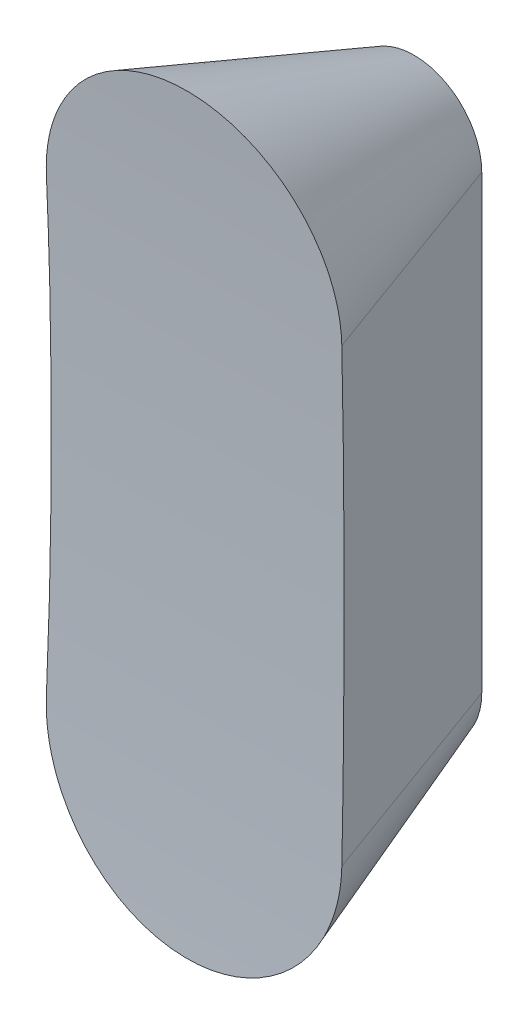
ISO-10303-21;
HEADER;
FILE_DESCRIPTION(('STEP AP214'),'2;1');
FILE_NAME('part.step','',(''),(''),'','','');
FILE_SCHEMA(('AUTOMOTIVE_DESIGN { 1 0 10303 214 1 1 1 1 }'));
ENDSEC;
DATA;
#1=APPLICATION_CONTEXT('core data for automotive mechanical design processes');
#2=APPLICATION_PROTOCOL_DEFINITION('international standard','automotive_design',2000,#1);
#3=PRODUCT_CONTEXT('',#1,'mechanical');
#4=PRODUCT('Part','Part','',(#3));
#5=PRODUCT_RELATED_PRODUCT_CATEGORY('part','',(#4));
#6=PRODUCT_DEFINITION_FORMATION('','',#4);
#7=PRODUCT_DEFINITION_CONTEXT('part definition',#1,'design');
#8=PRODUCT_DEFINITION('design','',#6,#7);
#9=PRODUCT_DEFINITION_SHAPE('','',#8);
#10=(LENGTH_UNIT() NAMED_UNIT(*) SI_UNIT(.MILLI.,.METRE.));
#11=(NAMED_UNIT(*) PLANE_ANGLE_UNIT() SI_UNIT($,.RADIAN.));
#12=(NAMED_UNIT(*) SI_UNIT($,.STERADIAN.) SOLID_ANGLE_UNIT());
#13=UNCERTAINTY_MEASURE_WITH_UNIT(LENGTH_MEASURE(1.E-05),#10,'distance_accuracy_value','');
#14=(GEOMETRIC_REPRESENTATION_CONTEXT(3) GLOBAL_UNCERTAINTY_ASSIGNED_CONTEXT((#13)) GLOBAL_UNIT_ASSIGNED_CONTEXT((#10,
#11,#12)) REPRESENTATION_CONTEXT('',''));
#15=CARTESIAN_POINT('',(0.,0.,0.));
#16=DIRECTION('',(0.,0.,1.));
#17=DIRECTION('',(1.,0.,0.));
#18=AXIS2_PLACEMENT_3D('',#15,#16,#17);
#19=CARTESIAN_POINT('',(0.,250.,0.));
#20=DIRECTION('',(0.,0.,1.));
#21=DIRECTION('',(1.,0.,0.));
#22=AXIS2_PLACEMENT_3D('',#19,#20,#21);
#23=CONICAL_SURFACE('',#22,75.,0.349065850398867);
#24=DIRECTION('',(-0.342020143325669,0.,0.939692620785908));
#25=VECTOR('',#24,1.);
#26=CARTESIAN_POINT('',(-75.,250.,0.));
#27=LINE('',#26,#25);
#28=CARTESIAN_POINT('',(-163.808429496129,250.,243.999154697842));
#29=VERTEX_POINT('',#28);
#30=CARTESIAN_POINT('',(-75.,250.,0.));
#31=VERTEX_POINT('',#30);
#32=EDGE_CURVE('E52',#29,#31,#27,.F.);
#33=ORIENTED_EDGE('',*,*,#32,.F.);
#34=CARTESIAN_POINT('',(-163.808429496129,250.,243.999154697842));
#35=CARTESIAN_POINT('',(-163.824138974877,251.302593004817,244.042316746006));
#36=CARTESIAN_POINT('',(-163.824453488186,252.605308736778,244.085870428773));
#37=CARTESIAN_POINT('',(-163.794301054113,255.210357488361,244.173744609212));
#38=CARTESIAN_POINT('',(-163.763834120106,256.512690508149,244.218065106549));
#39=CARTESIAN_POINT('',(-163.626278469396,260.418043877899,244.35214769571));
#40=CARTESIAN_POINT('',(-163.473036483805,263.019549812274,244.443035233635));
#41=CARTESIAN_POINT('',(-163.043839186392,268.212260958937,244.627613557107));
#42=CARTESIAN_POINT('',(-162.767881563357,270.80346597629,244.72130439542));
#43=CARTESIAN_POINT('',(-162.093876599138,275.969928107472,244.911284981619));
#44=CARTESIAN_POINT('',(-161.695827103908,278.54518493911,245.007574775331));
#45=CARTESIAN_POINT('',(-160.779361008814,283.669309997764,245.20234034975));
#46=CARTESIAN_POINT('',(-160.26116230374,286.21821737261,245.300811884859));
#47=CARTESIAN_POINT('',(-159.105185662647,291.288567928056,245.499844608021));
#48=CARTESIAN_POINT('',(-158.467413054901,293.810012327125,245.600405702785));
#49=CARTESIAN_POINT('',(-157.073723565553,298.81978279249,245.803330914476));
#50=CARTESIAN_POINT('',(-156.317814978152,301.308111170529,245.905694904376));
#51=CARTESIAN_POINT('',(-154.6895829523,306.246010779123,246.11191147049));
#52=CARTESIAN_POINT('',(-153.817270697398,308.695585707682,246.215763902845));
#53=CARTESIAN_POINT('',(-151.778637815122,314.019354071065,246.444793120821));
#54=CARTESIAN_POINT('',(-150.588063754621,316.884286118912,246.570218240378));
#55=CARTESIAN_POINT('',(-148.047641029103,322.542298009979,246.822110753892));
#56=CARTESIAN_POINT('',(-146.697802986562,325.335382630111,246.948578077816));
#57=CARTESIAN_POINT('',(-143.842988731992,330.841038742583,247.201910206078));
#58=CARTESIAN_POINT('',(-142.338015647273,333.553611856506,247.328775002354));
#59=CARTESIAN_POINT('',(-139.178188361029,338.8886252872,247.582161292581));
#60=CARTESIAN_POINT('',(-137.523391764012,341.511099714845,247.708682899373));
#61=CARTESIAN_POINT('',(-134.068557164362,346.658653278721,247.960702210907));
#62=CARTESIAN_POINT('',(-132.268516793272,349.183730825729,248.086199898917));
#63=CARTESIAN_POINT('',(-128.528729307526,354.128438362874,248.335411993899));
#64=CARTESIAN_POINT('',(-126.588982117752,356.548068296312,248.459126399914));
#65=CARTESIAN_POINT('',(-123.080172029691,360.680179860328,248.673212369987));
#66=CARTESIAN_POINT('',(-121.540401664562,362.417608623296,248.764152736807));
#67=CARTESIAN_POINT('',(-118.388533524097,365.825950287013,248.944259217922));
#68=CARTESIAN_POINT('',(-116.776431171362,367.496858965496,249.033425219412));
#69=CARTESIAN_POINT('',(-113.483007412971,370.768798836694,249.209624130734));
#70=CARTESIAN_POINT('',(-111.801692320131,372.369836374956,249.296657233955));
#71=CARTESIAN_POINT('',(-108.372453604261,375.499463731837,249.46826482141));
#72=CARTESIAN_POINT('',(-106.624522362655,377.028045218873,249.552839022468));
#73=CARTESIAN_POINT('',(-103.064980023868,380.010035950845,249.719189086808));
#74=CARTESIAN_POINT('',(-101.253356976029,381.463430960547,249.800964419188));
#75=CARTESIAN_POINT('',(-97.5701634565894,384.291893045529,249.961347575202));
#76=CARTESIAN_POINT('',(-95.6985999332024,385.66696914845,250.0399557636));
#77=CARTESIAN_POINT('',(-91.898464584018,388.336551001351,250.193683144911));
#78=CARTESIAN_POINT('',(-89.9698877997245,389.631049712854,250.268802032886));
#79=CARTESIAN_POINT('',(-86.0595033157494,392.136823313228,250.415204974088));
#80=CARTESIAN_POINT('',(-84.0776991130961,393.348103651012,250.486489278325));
#81=CARTESIAN_POINT('',(-79.4104473017019,396.065994744086,250.647453872934));
#82=CARTESIAN_POINT('',(-76.7060486216337,397.540305754713,250.735564109122));
#83=CARTESIAN_POINT('',(-71.2182044082453,400.33392712875,250.903765467903));
#84=CARTESIAN_POINT('',(-68.4347589529521,401.653237645153,250.983856598412));
#85=CARTESIAN_POINT('',(-62.7975377416053,404.132531526956,251.135351919846));
#86=CARTESIAN_POINT('',(-59.9437621467421,405.292515257477,251.206756130679));
#87=CARTESIAN_POINT('',(-54.1753009252702,407.449137756237,251.340255924183));
#88=CARTESIAN_POINT('',(-51.2606222084204,408.445794942437,251.402352556381));
#89=CARTESIAN_POINT('',(-45.3793330399593,410.272576785312,251.516702575467));
#90=CARTESIAN_POINT('',(-42.4127224375371,411.102700958286,251.568955933764));
#91=CARTESIAN_POINT('',(-36.4371083490548,412.593599210427,251.663152008003));
#92=CARTESIAN_POINT('',(-33.4281052263547,413.254374740204,251.705094812262));
#93=CARTESIAN_POINT('',(-27.3992388337108,414.400183565596,251.778025526137));
#94=CARTESIAN_POINT('',(-24.3796113361672,414.88645282753,251.809090440358));
#95=CARTESIAN_POINT('',(-18.3176833901209,415.688247523905,251.860403388091));
#96=CARTESIAN_POINT('',(-15.2753829908981,416.003773329349,251.880651445107));
#97=CARTESIAN_POINT('',(-9.1778017649429,416.463019085553,251.910146176003));
#98=CARTESIAN_POINT('',(-6.12252099192,416.606739746506,251.919392895359));
#99=CARTESIAN_POINT('',(-0.00870408280918963,416.721893381376,251.926800476216));
#100=CARTESIAN_POINT('',(3.04983204942047,416.693326559261,251.92496135084));
#101=CARTESIAN_POINT('',(9.16042689096425,416.464001588579,251.910214100336));
#102=CARTESIAN_POINT('',(12.2124855740793,416.263242744878,251.897305930522));
#103=CARTESIAN_POINT('',(18.300374840055,415.690210444177,251.860538626549));
#104=CARTESIAN_POINT('',(21.3362055191224,415.317938005127,251.836679557386));
#105=CARTESIAN_POINT('',(27.3702280017173,414.404912500142,251.778341219325));
#106=CARTESIAN_POINT('',(30.3685203102199,413.864820802491,251.743903645819));
#107=CARTESIAN_POINT('',(36.3299937905105,412.617496457932,251.664685720728));
#108=CARTESIAN_POINT('',(39.2931749826225,411.910263907779,251.619905375129));
#109=CARTESIAN_POINT('',(45.1751050768416,410.33100685625,251.520397377204));
#110=CARTESIAN_POINT('',(48.0938541938086,409.458983152027,251.465669772995));
#111=CARTESIAN_POINT('',(53.8778134979388,407.553015851563,251.346742323385));
#112=CARTESIAN_POINT('',(56.7430234172335,406.519071445438,251.282542430605));
#113=CARTESIAN_POINT('',(62.4109665239395,404.29265793842,251.14521774178));
#114=CARTESIAN_POINT('',(65.2136994665428,403.100188216493,251.072092910771));
#115=CARTESIAN_POINT('',(70.7479719819577,400.560624223612,250.917528696037));
#116=CARTESIAN_POINT('',(73.479511594811,399.213530039625,250.836089316989));
#117=CARTESIAN_POINT('',(78.8704102335064,396.365152124639,250.665322680705));
#118=CARTESIAN_POINT('',(81.5295485299199,394.863451909788,250.575974213373));
#119=CARTESIAN_POINT('',(86.7595299980269,391.713835021106,250.390294226348));
#120=CARTESIAN_POINT('',(89.3303728434509,390.065917807055,250.293962680854));
#121=CARTESIAN_POINT('',(94.3758259306913,386.629192867642,250.095061532535));
#122=CARTESIAN_POINT('',(96.8504364882494,384.840385604604,249.992491950178));
#123=CARTESIAN_POINT('',(101.695767412705,381.127665712563,249.781884786001));
#124=CARTESIAN_POINT('',(104.066491318424,379.203757691486,249.673847390707));
#125=CARTESIAN_POINT('',(108.696884358183,375.226928486421,249.453082335658));
#126=CARTESIAN_POINT('',(110.95655325801,373.174007030364,249.340354666012));
#127=CARTESIAN_POINT('',(115.358031095059,368.945566559879,249.110988774493));
#128=CARTESIAN_POINT('',(117.499839947216,366.770047456965,248.994350549799));
#129=CARTESIAN_POINT('',(121.149649450327,362.850408704804,248.78690036393));
#130=CARTESIAN_POINT('',(122.684430261428,361.131091280692,248.696757713221));
#131=CARTESIAN_POINT('',(125.680548290378,357.629432003796,248.515012114357));
#132=CARTESIAN_POINT('',(127.141880812691,355.847086133992,248.423409073332));
#133=CARTESIAN_POINT('',(129.988325128863,352.2228316597,248.239083282353));
#134=CARTESIAN_POINT('',(131.373442748867,350.380927625193,248.146360618649));
#135=CARTESIAN_POINT('',(134.06536124714,346.6404742092,247.960095611615));
#136=CARTESIAN_POINT('',(135.372153285619,344.741918470109,247.866553177125));
#137=CARTESIAN_POINT('',(137.905517154398,340.890942376669,247.678930560874));
#138=CARTESIAN_POINT('',(139.132056292289,338.938500525721,247.584850176732));
#139=CARTESIAN_POINT('',(141.502096226837,334.984163245174,247.396499793453));
#140=CARTESIAN_POINT('',(142.645606308883,332.982273379157,247.302229816734));
#141=CARTESIAN_POINT('',(144.847845907257,328.932224220805,247.113772331347));
#142=CARTESIAN_POINT('',(145.906570577155,326.884062292075,247.019584827696));
#143=CARTESIAN_POINT('',(147.937263707518,322.745371863848,246.831582601732));
#144=CARTESIAN_POINT('',(148.909237503368,320.654845979552,246.737767856833));
#145=CARTESIAN_POINT('',(151.08265404974,315.712160424311,246.518739353487));
#146=CARTESIAN_POINT('',(152.248695528943,312.844335735073,246.393774665203));
#147=CARTESIAN_POINT('',(154.417943827059,307.047629896744,246.145577024355));
#148=CARTESIAN_POINT('',(155.421143316862,304.118746006224,246.022344149964));
#149=CARTESIAN_POINT('',(157.261711374175,298.208762152271,245.778145491592));
#150=CARTESIAN_POINT('',(158.099056704662,295.227654935677,245.657180027433));
#151=CARTESIAN_POINT('',(159.603972289303,289.227584861189,245.418219157647));
#152=CARTESIAN_POINT('',(160.271798356496,286.208686344324,245.30021952184));
#153=CARTESIAN_POINT('',(161.437155618205,280.13859642502,245.067470112903));
#154=CARTESIAN_POINT('',(161.934712032255,277.087409874007,244.952719860801));
#155=CARTESIAN_POINT('',(162.757881082237,270.963290915224,244.726903371373));
#156=CARTESIAN_POINT('',(163.083588690863,267.890371471846,244.615835131051));
#157=CARTESIAN_POINT('',(163.41881311453,263.578429410696,244.463106687411));
#158=CARTESIAN_POINT('',(163.500812668356,262.344748136089,244.419766533345));
#159=CARTESIAN_POINT('',(163.637116079956,259.876034440405,244.333748945228));
#160=CARTESIAN_POINT('',(163.691425228728,258.641002322673,244.291071386083));
#161=CARTESIAN_POINT('',(163.772273077254,256.17188682894,244.206455128159));
#162=CARTESIAN_POINT('',(163.798853687804,254.937804846552,244.164515408774));
#163=CARTESIAN_POINT('',(163.82437960108,252.46909847415,244.081317537346));
#164=CARTESIAN_POINT('',(163.823319676493,251.234474025694,244.040059515701));
#165=CARTESIAN_POINT('',(163.808429496129,250.,243.999154697842));
#166=B_SPLINE_CURVE_WITH_KNOTS('',3,(#34,#35,#36,#37,#38,#39,#40,#41,#42,#43,#44,#45,#46,#47,
#48,#49,#50,#51,#52,#53,#54,#55,#56,#57,#58,#59,#60,#61,#62,#63,#64,#65,#66,#67,#68,#69,#70,#71,
#72,#73,#74,#75,#76,#77,#78,#79,#80,#81,#82,#83,#84,#85,#86,#87,#88,#89,#90,#91,#92,#93,#94,#95,
#96,#97,#98,#99,#100,#101,#102,#103,#104,#105,#106,#107,#108,#109,#110,#111,#112,#113,#114,#115,
#116,#117,#118,#119,#120,#121,#122,#123,#124,#125,#126,#127,#128,#129,#130,#131,#132,#133,#134,
#135,#136,#137,#138,#139,#140,#141,#142,#143,#144,#145,#146,#147,#148,#149,#150,#151,#152,#153,
#154,#155,#156,#157,#158,#159,#160,#161,#162,#163,#164,#165),.UNSPECIFIED.,.F.,.F.,(4,2,2,2,2,2,
2,2,2,2,2,2,2,2,2,2,2,2,2,2,2,2,2,2,2,2,2,2,2,2,2,2,2,2,2,2,2,2,2,2,2,2,2,2,2,2,2,2,2,2,2,2,2,2,
2,2,2,2,2,2,2,2,2,2,2,4),(0.,3.91001699583537,7.82003229279667,15.6396692184233,
23.4594534244418,31.2793756015378,39.0852254934816,46.890727635524,54.6956820075476,
62.4998870532013,71.8098322484426,81.1191568461507,90.4282938173458,99.7338666663532,
109.039591289972,118.345320917184,125.313334356295,132.281789377104,139.249610215161,
146.218230335492,153.188165048213,160.157294719653,167.127032296313,174.09631307767,
183.335427199796,192.57453220231,201.813616031608,211.051657272546,220.289725345344,
229.52771428378,238.698918642362,247.87010307303,257.041249592571,266.212385254548,
275.383557940264,284.554676194755,293.690100316407,302.825519149742,311.960893792906,
321.096314130155,330.23177025707,339.367221245753,348.527959684747,357.688731970894,
366.849474197671,376.009904127587,385.170353375962,394.330809235932,401.248259582074,
408.16615159839,415.083514049055,422.001655725962,428.92259830358,435.842765695369,
442.763328369782,449.683465119424,458.973364649304,468.263682178472,477.555300409771,
486.832812631783,496.108950117267,505.379955737063,509.091218170006,512.801771200256,
516.50670768673,520.212344847321),.UNSPECIFIED.);
#167=CARTESIAN_POINT('',(163.808429496129,250.,243.999154697842));
#168=VERTEX_POINT('',#167);
#169=EDGE_CURVE('E84',#29,#168,#166,.T.);
#170=ORIENTED_EDGE('',*,*,#169,.T.);
#171=DIRECTION('',(0.342020143325669,0.,0.939692620785908));
#172=VECTOR('',#171,1.);
#173=CARTESIAN_POINT('',(75.,250.,0.));
#174=LINE('',#173,#172);
#175=CARTESIAN_POINT('',(75.,250.,0.));
#176=VERTEX_POINT('',#175);
#177=EDGE_CURVE('E66',#168,#176,#174,.F.);
#178=ORIENTED_EDGE('',*,*,#177,.T.);
#179=CARTESIAN_POINT('',(0.,250.,0.));
#180=DIRECTION('',(0.,0.,1.));
#181=DIRECTION('',(1.,0.,0.));
#182=AXIS2_PLACEMENT_3D('',#179,#180,#181);
#183=CIRCLE('',#182,75.);
#184=EDGE_CURVE('E89',#176,#31,#183,.T.);
#185=ORIENTED_EDGE('',*,*,#184,.T.);
#186=EDGE_LOOP('',(#33,#170,#178,#185));
#187=FACE_BOUND('',#186,.T.);
#188=ADVANCED_FACE('F37',(#187),#23,.T.);
#189=CARTESIAN_POINT('',(-75.,-250.,0.));
#190=DIRECTION('',(-0.939692620785908,0.,-0.342020143325669));
#191=DIRECTION('',(-0.342020143325669,0.,0.939692620785908));
#192=AXIS2_PLACEMENT_3D('',#189,#190,#191);
#193=PLANE('',#192);
#194=DIRECTION('',(-0.342020143325669,0.,0.939692620785908));
#195=VECTOR('',#194,1.);
#196=CARTESIAN_POINT('',(-75.,-250.,0.));
#197=LINE('',#196,#195);
#198=CARTESIAN_POINT('',(-163.808429496129,-250.,243.999154697842));
#199=VERTEX_POINT('',#198);
#200=CARTESIAN_POINT('',(-75.,-250.,0.));
#201=VERTEX_POINT('',#200);
#202=EDGE_CURVE('E98',#199,#201,#197,.F.);
#203=ORIENTED_EDGE('',*,*,#202,.F.);
#204=CARTESIAN_POINT('',(-163.808429496129,-250.,243.999154697842));
#205=CARTESIAN_POINT('',(-163.724693625356,-243.05639621235,243.769092283694));
#206=CARTESIAN_POINT('',(-163.644944676802,-236.112384270873,243.549983848317));
#207=CARTESIAN_POINT('',(-163.493177895972,-222.223643063474,243.133008044963));
#208=CARTESIAN_POINT('',(-163.421160057853,-215.278913798099,242.935140660933));
#209=CARTESIAN_POINT('',(-163.284624305591,-201.39001269945,242.560011764646));
#210=CARTESIAN_POINT('',(-163.220105112502,-194.445840973578,242.382746738511));
#211=CARTESIAN_POINT('',(-163.09835360853,-180.556952580874,242.048237230564));
#212=CARTESIAN_POINT('',(-163.041121299247,-173.612235913923,241.890992753147));
#213=CARTESIAN_POINT('',(-162.880100147947,-152.779196918257,241.448590775895));
#214=CARTESIAN_POINT('',(-162.786969222547,-138.890158906917,241.192715661306));
#215=CARTESIAN_POINT('',(-162.6280475878,-111.112081519346,240.756082058375));
#216=CARTESIAN_POINT('',(-162.562254280758,-97.2230422687103,240.575316432925));
#217=CARTESIAN_POINT('',(-162.457271612517,-69.4449823613137,240.286878922499));
#218=CARTESIAN_POINT('',(-162.418080570569,-55.5559617588304,240.179202419702));
#219=CARTESIAN_POINT('',(-162.365873308315,-27.7779607616904,240.035764145527));
#220=CARTESIAN_POINT('',(-162.352856223889,-13.8889803808452,240.));
#221=CARTESIAN_POINT('',(-162.352856223889,13.8889803808452,240.));
#222=CARTESIAN_POINT('',(-162.365873308315,27.7779607616904,240.035764145527));
#223=CARTESIAN_POINT('',(-162.418080570569,55.5559617588303,240.179202419702));
#224=CARTESIAN_POINT('',(-162.457271612517,69.4449823613137,240.286878922498));
#225=CARTESIAN_POINT('',(-162.562254280758,97.2230422687103,240.575316432925));
#226=CARTESIAN_POINT('',(-162.6280475878,111.112081519346,240.756082058374));
#227=CARTESIAN_POINT('',(-162.786969222547,138.890158906917,241.192715661306));
#228=CARTESIAN_POINT('',(-162.880100147947,152.779196918257,241.448590775895));
#229=CARTESIAN_POINT('',(-163.041121299247,173.612235913923,241.890992753147));
#230=CARTESIAN_POINT('',(-163.09835360853,180.556952580874,242.048237230564));
#231=CARTESIAN_POINT('',(-163.220105112502,194.445840973578,242.382746738511));
#232=CARTESIAN_POINT('',(-163.284624305591,201.39001269945,242.560011764646));
#233=CARTESIAN_POINT('',(-163.421160057853,215.278913798099,242.935140660933));
#234=CARTESIAN_POINT('',(-163.493177895972,222.223643063474,243.133008044963));
#235=CARTESIAN_POINT('',(-163.644944676802,236.112384270873,243.549983848316));
#236=CARTESIAN_POINT('',(-163.724693625356,243.05639621235,243.769092283694));
#237=CARTESIAN_POINT('',(-163.808429496129,250.,243.999154697842));
#238=B_SPLINE_CURVE_WITH_KNOTS('',3,(#204,#205,#206,#207,#208,#209,#210,#211,#212,#213,#214,
#215,#216,#217,#218,#219,#220,#221,#222,#223,#224,#225,#226,#227,#228,#229,#230,#231,#232,#233,
#234,#235,#236,#237),.UNSPECIFIED.,.F.,.F.,(4,2,2,2,2,2,2,2,2,2,2,2,2,2,2,2,4),(0.,
20.8437418955119,41.6874680362387,62.5276338979756,83.3678043338471,125.042662993465,
166.713560689117,208.381825344629,250.048714321282,291.715603297935,333.383867953447,
375.054765649099,416.729624308717,437.569794744588,458.409960606325,479.253686747052,
500.097428642564),.UNSPECIFIED.);
#239=EDGE_CURVE('E90',#199,#29,#238,.T.);
#240=ORIENTED_EDGE('',*,*,#239,.T.);
#241=ORIENTED_EDGE('',*,*,#32,.T.);
#242=DIRECTION('',(0.,-1.,0.));
#243=VECTOR('',#242,1.);
#244=CARTESIAN_POINT('',(-75.,-250.,0.));
#245=LINE('',#244,#243);
#246=EDGE_CURVE('E109',#31,#201,#245,.T.);
#247=ORIENTED_EDGE('',*,*,#246,.T.);
#248=EDGE_LOOP('',(#203,#240,#241,#247));
#249=FACE_BOUND('',#248,.T.);
#250=ADVANCED_FACE('F39',(#249),#193,.T.);
#251=CARTESIAN_POINT('',(0.,-250.,0.));
#252=DIRECTION('',(0.,0.,1.));
#253=DIRECTION('',(-1.,0.,0.));
#254=AXIS2_PLACEMENT_3D('',#251,#252,#253);
#255=CONICAL_SURFACE('',#254,75.,0.349065850398867);
#256=DIRECTION('',(0.342020143325669,0.,0.939692620785908));
#257=VECTOR('',#256,1.);
#258=CARTESIAN_POINT('',(75.,-250.,0.));
#259=LINE('',#258,#257);
#260=CARTESIAN_POINT('',(163.808429496129,-250.,243.999154697842));
#261=VERTEX_POINT('',#260);
#262=CARTESIAN_POINT('',(75.,-250.,0.));
#263=VERTEX_POINT('',#262);
#264=EDGE_CURVE('E96',#261,#263,#259,.F.);
#265=ORIENTED_EDGE('',*,*,#264,.F.);
#266=CARTESIAN_POINT('',(163.808429496129,-250.,243.999154697842));
#267=CARTESIAN_POINT('',(163.824138974877,-251.302593004817,244.042316746006));
#268=CARTESIAN_POINT('',(163.824453488186,-252.605308736778,244.085870428774));
#269=CARTESIAN_POINT('',(163.794301054114,-255.210357488361,244.173744609212));
#270=CARTESIAN_POINT('',(163.763834120106,-256.512690508149,244.21806510655));
#271=CARTESIAN_POINT('',(163.626278469396,-260.418043877899,244.35214769571));
#272=CARTESIAN_POINT('',(163.473036483805,-263.019549812274,244.443035233635));
#273=CARTESIAN_POINT('',(163.043839186392,-268.212260958937,244.627613557107));
#274=CARTESIAN_POINT('',(162.767881563357,-270.80346597629,244.72130439542));
#275=CARTESIAN_POINT('',(162.093876599138,-275.969928107472,244.911284981619));
#276=CARTESIAN_POINT('',(161.695827103908,-278.54518493911,245.007574775331));
#277=CARTESIAN_POINT('',(160.779361008814,-283.669309997764,245.20234034975));
#278=CARTESIAN_POINT('',(160.26116230374,-286.21821737261,245.300811884859));
#279=CARTESIAN_POINT('',(159.105185662647,-291.288567928056,245.499844608021));
#280=CARTESIAN_POINT('',(158.467413054901,-293.810012327125,245.600405702785));
#281=CARTESIAN_POINT('',(157.073723565553,-298.81978279249,245.803330914476));
#282=CARTESIAN_POINT('',(156.317814978152,-301.308111170529,245.905694904376));
#283=CARTESIAN_POINT('',(154.6895829523,-306.246010779123,246.11191147049));
#284=CARTESIAN_POINT('',(153.817270697398,-308.695585707682,246.215763902845));
#285=CARTESIAN_POINT('',(151.778637815122,-314.019354071065,246.444793120821));
#286=CARTESIAN_POINT('',(150.588063754621,-316.884286118912,246.570218240378));
#287=CARTESIAN_POINT('',(148.047641029103,-322.542298009979,246.822110753893));
#288=CARTESIAN_POINT('',(146.697802986562,-325.335382630111,246.948578077816));
#289=CARTESIAN_POINT('',(143.842988731992,-330.841038742584,247.201910206078));
#290=CARTESIAN_POINT('',(142.338015647273,-333.553611856507,247.328775002354));
#291=CARTESIAN_POINT('',(139.178188361029,-338.8886252872,247.582161292581));
#292=CARTESIAN_POINT('',(137.523391764012,-341.511099714845,247.708682899373));
#293=CARTESIAN_POINT('',(134.068557164362,-346.658653278721,247.960702210908));
#294=CARTESIAN_POINT('',(132.268516793272,-349.183730825729,248.086199898917));
#295=CARTESIAN_POINT('',(128.528729307526,-354.128438362874,248.3354119939));
#296=CARTESIAN_POINT('',(126.588982117752,-356.548068296312,248.459126399915));
#297=CARTESIAN_POINT('',(123.080172029691,-360.680179860328,248.673212369987));
#298=CARTESIAN_POINT('',(121.540401664562,-362.417608623296,248.764152736807));
#299=CARTESIAN_POINT('',(118.388533524097,-365.825950287013,248.944259217922));
#300=CARTESIAN_POINT('',(116.776431171362,-367.496858965496,249.033425219413));
#301=CARTESIAN_POINT('',(113.483007412972,-370.768798836694,249.209624130735));
#302=CARTESIAN_POINT('',(111.801692320131,-372.369836374957,249.296657233956));
#303=CARTESIAN_POINT('',(108.372453604261,-375.499463731837,249.46826482141));
#304=CARTESIAN_POINT('',(106.624522362655,-377.028045218873,249.552839022469));
#305=CARTESIAN_POINT('',(103.064980023868,-380.010035950845,249.719189086808));
#306=CARTESIAN_POINT('',(101.253356976029,-381.463430960547,249.800964419188));
#307=CARTESIAN_POINT('',(97.5701634565895,-384.291893045529,249.961347575203));
#308=CARTESIAN_POINT('',(95.6985999332026,-385.66696914845,250.039955763601));
#309=CARTESIAN_POINT('',(91.8984645840182,-388.336551001351,250.193683144911));
#310=CARTESIAN_POINT('',(89.9698877997247,-389.631049712854,250.268802032886));
#311=CARTESIAN_POINT('',(86.0595033157495,-392.136823313228,250.415204974088));
#312=CARTESIAN_POINT('',(84.0776991130962,-393.348103651012,250.486489278326));
#313=CARTESIAN_POINT('',(79.410447301702,-396.065994744086,250.647453872934));
#314=CARTESIAN_POINT('',(76.7060486216339,-397.540305754713,250.735564109122));
#315=CARTESIAN_POINT('',(71.2182044082455,-400.33392712875,250.903765467903));
#316=CARTESIAN_POINT('',(68.4347589529522,-401.653237645154,250.983856598412));
#317=CARTESIAN_POINT('',(62.7975377416055,-404.132531526956,251.135351919847));
#318=CARTESIAN_POINT('',(59.9437621467422,-405.292515257477,251.20675613068));
#319=CARTESIAN_POINT('',(54.1753009252703,-407.449137756237,251.340255924184));
#320=CARTESIAN_POINT('',(51.2606222084205,-408.445794942437,251.402352556381));
#321=CARTESIAN_POINT('',(45.3793330399595,-410.272576785312,251.516702575467));
#322=CARTESIAN_POINT('',(42.4127224375373,-411.102700958287,251.568955933765));
#323=CARTESIAN_POINT('',(36.4371083490549,-412.593599210427,251.663152008003));
#324=CARTESIAN_POINT('',(33.4281052263548,-413.254374740204,251.705094812263));
#325=CARTESIAN_POINT('',(27.3992388337108,-414.400183565596,251.778025526137));
#326=CARTESIAN_POINT('',(24.3796113361673,-414.88645282753,251.809090440358));
#327=CARTESIAN_POINT('',(18.317683390121,-415.688247523905,251.860403388091));
#328=CARTESIAN_POINT('',(15.2753829908982,-416.003773329349,251.880651445107));
#329=CARTESIAN_POINT('',(9.17780176494299,-416.463019085553,251.910146176003));
#330=CARTESIAN_POINT('',(6.12252099192009,-416.606739746506,251.91939289536));
#331=CARTESIAN_POINT('',(0.00870408280927246,-416.721893381376,251.926800476216));
#332=CARTESIAN_POINT('',(-3.04983204942039,-416.693326559261,251.924961350841));
#333=CARTESIAN_POINT('',(-9.16042689096417,-416.464001588579,251.910214100336));
#334=CARTESIAN_POINT('',(-12.2124855740792,-416.263242744879,251.897305930522));
#335=CARTESIAN_POINT('',(-18.3003748400549,-415.690210444177,251.86053862655));
#336=CARTESIAN_POINT('',(-21.3362055191224,-415.317938005128,251.836679557386));
#337=CARTESIAN_POINT('',(-27.3702280017172,-414.404912500142,251.778341219325));
#338=CARTESIAN_POINT('',(-30.3685203102198,-413.864820802491,251.743903645819));
#339=CARTESIAN_POINT('',(-36.3299937905104,-412.617496457932,251.664685720728));
#340=CARTESIAN_POINT('',(-39.2931749826225,-411.910263907779,251.61990537513));
#341=CARTESIAN_POINT('',(-45.1751050768415,-410.33100685625,251.520397377204));
#342=CARTESIAN_POINT('',(-48.0938541938086,-409.458983152028,251.465669772996));
#343=CARTESIAN_POINT('',(-53.8778134979388,-407.553015851563,251.346742323385));
#344=CARTESIAN_POINT('',(-56.7430234172335,-406.519071445438,251.282542430605));
#345=CARTESIAN_POINT('',(-62.4109665239394,-404.29265793842,251.145217741781));
#346=CARTESIAN_POINT('',(-65.2136994665428,-403.100188216494,251.072092910771));
#347=CARTESIAN_POINT('',(-70.7479719819577,-400.560624223612,250.917528696037));
#348=CARTESIAN_POINT('',(-73.4795115948109,-399.213530039625,250.836089316989));
#349=CARTESIAN_POINT('',(-78.8704102335065,-396.365152124639,250.665322680706));
#350=CARTESIAN_POINT('',(-81.5295485299199,-394.863451909788,250.575974213373));
#351=CARTESIAN_POINT('',(-86.759529998027,-391.713835021106,250.390294226348));
#352=CARTESIAN_POINT('',(-89.3303728434509,-390.065917807055,250.293962680855));
#353=CARTESIAN_POINT('',(-94.3758259306913,-386.629192867642,250.095061532535));
#354=CARTESIAN_POINT('',(-96.8504364882494,-384.840385604605,249.992491950179));
#355=CARTESIAN_POINT('',(-101.695767412705,-381.127665712564,249.781884786001));
#356=CARTESIAN_POINT('',(-104.066491318424,-379.203757691487,249.673847390708));
#357=CARTESIAN_POINT('',(-108.696884358183,-375.226928486421,249.453082335659));
#358=CARTESIAN_POINT('',(-110.956553258009,-373.174007030365,249.340354666012));
#359=CARTESIAN_POINT('',(-115.358031095059,-368.945566559879,249.110988774494));
#360=CARTESIAN_POINT('',(-117.499839947216,-366.770047456965,248.994350549799));
#361=CARTESIAN_POINT('',(-121.149649450327,-362.850408704804,248.78690036393));
#362=CARTESIAN_POINT('',(-122.684430261428,-361.131091280693,248.696757713221));
#363=CARTESIAN_POINT('',(-125.680548290378,-357.629432003796,248.515012114357));
#364=CARTESIAN_POINT('',(-127.141880812691,-355.847086133992,248.423409073332));
#365=CARTESIAN_POINT('',(-129.988325128863,-352.2228316597,248.239083282353));
#366=CARTESIAN_POINT('',(-131.373442748867,-350.380927625193,248.146360618649));
#367=CARTESIAN_POINT('',(-134.06536124714,-346.6404742092,247.960095611615));
#368=CARTESIAN_POINT('',(-135.372153285619,-344.741918470109,247.866553177125));
#369=CARTESIAN_POINT('',(-137.905517154398,-340.890942376669,247.678930560875));
#370=CARTESIAN_POINT('',(-139.132056292289,-338.938500525721,247.584850176732));
#371=CARTESIAN_POINT('',(-141.502096226837,-334.984163245174,247.396499793453));
#372=CARTESIAN_POINT('',(-142.645606308883,-332.982273379157,247.302229816734));
#373=CARTESIAN_POINT('',(-144.847845907257,-328.932224220805,247.113772331347));
#374=CARTESIAN_POINT('',(-145.906570577155,-326.884062292075,247.019584827696));
#375=CARTESIAN_POINT('',(-147.937263707518,-322.745371863848,246.831582601732));
#376=CARTESIAN_POINT('',(-148.909237503368,-320.654845979552,246.737767856833));
#377=CARTESIAN_POINT('',(-151.08265404974,-315.712160424311,246.518739353487));
#378=CARTESIAN_POINT('',(-152.248695528943,-312.844335735072,246.393774665203));
#379=CARTESIAN_POINT('',(-154.417943827059,-307.047629896744,246.145577024355));
#380=CARTESIAN_POINT('',(-155.421143316862,-304.118746006223,246.022344149964));
#381=CARTESIAN_POINT('',(-157.261711374175,-298.208762152271,245.778145491592));
#382=CARTESIAN_POINT('',(-158.099056704662,-295.227654935677,245.657180027434));
#383=CARTESIAN_POINT('',(-159.603972289303,-289.227584861189,245.418219157647));
#384=CARTESIAN_POINT('',(-160.271798356496,-286.208686344324,245.300219521841));
#385=CARTESIAN_POINT('',(-161.437155618205,-280.13859642502,245.067470112904));
#386=CARTESIAN_POINT('',(-161.934712032255,-277.087409874007,244.952719860801));
#387=CARTESIAN_POINT('',(-162.757881082237,-270.963290915224,244.726903371374));
#388=CARTESIAN_POINT('',(-163.083588690863,-267.890371471846,244.615835131051));
#389=CARTESIAN_POINT('',(-163.41881311453,-263.578429410696,244.463106687411));
#390=CARTESIAN_POINT('',(-163.500812668356,-262.344748136089,244.419766533345));
#391=CARTESIAN_POINT('',(-163.637116079956,-259.876034440405,244.333748945228));
#392=CARTESIAN_POINT('',(-163.691425228728,-258.641002322673,244.291071386084));
#393=CARTESIAN_POINT('',(-163.772273077254,-256.17188682894,244.20645512816));
#394=CARTESIAN_POINT('',(-163.798853687804,-254.937804846552,244.164515408774));
#395=CARTESIAN_POINT('',(-163.82437960108,-252.46909847415,244.081317537346));
#396=CARTESIAN_POINT('',(-163.823319676493,-251.234474025694,244.040059515701));
#397=CARTESIAN_POINT('',(-163.808429496129,-250.,243.999154697842));
#398=B_SPLINE_CURVE_WITH_KNOTS('',3,(#266,#267,#268,#269,#270,#271,#272,#273,#274,#275,#276,
#277,#278,#279,#280,#281,#282,#283,#284,#285,#286,#287,#288,#289,#290,#291,#292,#293,#294,#295,
#296,#297,#298,#299,#300,#301,#302,#303,#304,#305,#306,#307,#308,#309,#310,#311,#312,#313,#314,
#315,#316,#317,#318,#319,#320,#321,#322,#323,#324,#325,#326,#327,#328,#329,#330,#331,#332,#333,
#334,#335,#336,#337,#338,#339,#340,#341,#342,#343,#344,#345,#346,#347,#348,#349,#350,#351,#352,
#353,#354,#355,#356,#357,#358,#359,#360,#361,#362,#363,#364,#365,#366,#367,#368,#369,#370,#371,
#372,#373,#374,#375,#376,#377,#378,#379,#380,#381,#382,#383,#384,#385,#386,#387,#388,#389,#390,
#391,#392,#393,#394,#395,#396,#397),.UNSPECIFIED.,.F.,.F.,(4,2,2,2,2,2,2,2,2,2,2,2,2,2,2,2,2,2,
2,2,2,2,2,2,2,2,2,2,2,2,2,2,2,2,2,2,2,2,2,2,2,2,2,2,2,2,2,2,2,2,2,2,2,2,2,2,2,2,2,2,2,2,2,2,2,
4),(0.,3.91001699583537,7.82003229279668,15.6396692184233,23.4594534244418,31.2793756015378,
39.0852254934816,46.890727635524,54.6956820075476,62.4998870532013,71.8098322484426,
81.1191568461509,90.4282938173459,99.7338666663533,109.039591289972,118.345320917184,
125.313334356295,132.281789377104,139.249610215161,146.218230335492,153.188165048213,
160.157294719653,167.127032296313,174.09631307767,183.335427199796,192.57453220231,
201.813616031608,211.051657272546,220.289725345344,229.52771428378,238.698918642362,
247.870103073031,257.041249592571,266.212385254549,275.383557940264,284.554676194755,
293.690100316407,302.825519149742,311.960893792907,321.096314130155,330.23177025707,
339.367221245754,348.527959684747,357.688731970894,366.849474197671,376.009904127588,
385.170353375962,394.330809235932,401.248259582074,408.16615159839,415.083514049055,
422.001655725962,428.92259830358,435.842765695369,442.763328369783,449.683465119424,
458.973364649305,468.263682178472,477.555300409772,486.832812631783,496.108950117267,
505.379955737063,509.091218170006,512.801771200256,516.506707686731,520.212344847321),.UNSPECIFIED.);
#399=EDGE_CURVE('E59',#261,#199,#398,.T.);
#400=ORIENTED_EDGE('',*,*,#399,.T.);
#401=ORIENTED_EDGE('',*,*,#202,.T.);
#402=CARTESIAN_POINT('',(0.,-250.,0.));
#403=DIRECTION('',(0.,0.,1.));
#404=DIRECTION('',(-1.,0.,0.));
#405=AXIS2_PLACEMENT_3D('',#402,#403,#404);
#406=CIRCLE('',#405,75.);
#407=EDGE_CURVE('E100',#201,#263,#406,.T.);
#408=ORIENTED_EDGE('',*,*,#407,.T.);
#409=EDGE_LOOP('',(#265,#400,#401,#408));
#410=FACE_BOUND('',#409,.T.);
#411=ADVANCED_FACE('F122',(#410),#255,.T.);
#412=CARTESIAN_POINT('',(75.,-250.,0.));
#413=DIRECTION('',(0.939692620785908,0.,-0.342020143325669));
#414=DIRECTION('',(-0.342020143325669,0.,-0.939692620785908));
#415=AXIS2_PLACEMENT_3D('',#412,#413,#414);
#416=PLANE('',#415);
#417=ORIENTED_EDGE('',*,*,#177,.F.);
#418=CARTESIAN_POINT('',(163.808429496129,250.,243.999154697842));
#419=CARTESIAN_POINT('',(163.724693625356,243.05639621235,243.769092283694));
#420=CARTESIAN_POINT('',(163.644944676802,236.112384270873,243.549983848316));
#421=CARTESIAN_POINT('',(163.493177895972,222.223643063474,243.133008044963));
#422=CARTESIAN_POINT('',(163.421160057853,215.278913798099,242.935140660933));
#423=CARTESIAN_POINT('',(163.284624305591,201.39001269945,242.560011764646));
#424=CARTESIAN_POINT('',(163.220105112502,194.445840973578,242.382746738511));
#425=CARTESIAN_POINT('',(163.09835360853,180.556952580874,242.048237230564));
#426=CARTESIAN_POINT('',(163.041121299247,173.612235913923,241.890992753147));
#427=CARTESIAN_POINT('',(162.880100147947,152.779196918257,241.448590775895));
#428=CARTESIAN_POINT('',(162.786969222547,138.890158906917,241.192715661306));
#429=CARTESIAN_POINT('',(162.6280475878,111.112081519346,240.756082058374));
#430=CARTESIAN_POINT('',(162.562254280758,97.2230422687103,240.575316432925));
#431=CARTESIAN_POINT('',(162.457271612517,69.4449823613137,240.286878922498));
#432=CARTESIAN_POINT('',(162.418080570569,55.5559617588304,240.179202419702));
#433=CARTESIAN_POINT('',(162.365873308315,27.7779607616904,240.035764145527));
#434=CARTESIAN_POINT('',(162.352856223889,13.8889803808452,240.));
#435=CARTESIAN_POINT('',(162.352856223889,-13.8889803808452,240.));
#436=CARTESIAN_POINT('',(162.365873308315,-27.7779607616904,240.035764145527));
#437=CARTESIAN_POINT('',(162.418080570569,-55.5559617588303,240.179202419702));
#438=CARTESIAN_POINT('',(162.457271612517,-69.4449823613137,240.286878922499));
#439=CARTESIAN_POINT('',(162.562254280758,-97.2230422687103,240.575316432925));
#440=CARTESIAN_POINT('',(162.6280475878,-111.112081519346,240.756082058375));
#441=CARTESIAN_POINT('',(162.786969222547,-138.890158906917,241.192715661306));
#442=CARTESIAN_POINT('',(162.880100147947,-152.779196918257,241.448590775895));
#443=CARTESIAN_POINT('',(163.041121299247,-173.612235913923,241.890992753147));
#444=CARTESIAN_POINT('',(163.09835360853,-180.556952580874,242.048237230564));
#445=CARTESIAN_POINT('',(163.220105112502,-194.445840973578,242.382746738511));
#446=CARTESIAN_POINT('',(163.284624305591,-201.39001269945,242.560011764646));
#447=CARTESIAN_POINT('',(163.421160057853,-215.278913798099,242.935140660933));
#448=CARTESIAN_POINT('',(163.493177895972,-222.223643063474,243.133008044963));
#449=CARTESIAN_POINT('',(163.644944676802,-236.112384270873,243.549983848317));
#450=CARTESIAN_POINT('',(163.724693625356,-243.05639621235,243.769092283694));
#451=CARTESIAN_POINT('',(163.808429496129,-250.,243.999154697842));
#452=B_SPLINE_CURVE_WITH_KNOTS('',3,(#418,#419,#420,#421,#422,#423,#424,#425,#426,#427,#428,
#429,#430,#431,#432,#433,#434,#435,#436,#437,#438,#439,#440,#441,#442,#443,#444,#445,#446,#447,
#448,#449,#450,#451),.UNSPECIFIED.,.F.,.F.,(4,2,2,2,2,2,2,2,2,2,2,2,2,2,2,2,4),(0.,
20.8437418955119,41.6874680362387,62.5276338979756,83.3678043338471,125.042662993465,
166.713560689117,208.381825344629,250.048714321282,291.715603297935,333.383867953447,
375.054765649099,416.729624308717,437.569794744588,458.409960606325,479.253686747052,
500.097428642564),.UNSPECIFIED.);
#453=EDGE_CURVE('E11',#168,#261,#452,.T.);
#454=ORIENTED_EDGE('',*,*,#453,.T.);
#455=ORIENTED_EDGE('',*,*,#264,.T.);
#456=DIRECTION('',(0.,1.,0.));
#457=VECTOR('',#456,1.);
#458=CARTESIAN_POINT('',(75.,-250.,0.));
#459=LINE('',#458,#457);
#460=EDGE_CURVE('E94',#263,#176,#459,.T.);
#461=ORIENTED_EDGE('',*,*,#460,.T.);
#462=EDGE_LOOP('',(#417,#454,#455,#461));
#463=FACE_BOUND('',#462,.T.);
#464=ADVANCED_FACE('F92',(#463),#416,.T.);
#465=CARTESIAN_POINT('',(0.,250.,0.));
#466=DIRECTION('',(0.,0.,1.));
#467=DIRECTION('',(1.,0.,0.));
#468=AXIS2_PLACEMENT_3D('',#465,#466,#467);
#469=PLANE('',#468);
#470=ORIENTED_EDGE('',*,*,#184,.F.);
#471=ORIENTED_EDGE('',*,*,#460,.F.);
#472=ORIENTED_EDGE('',*,*,#407,.F.);
#473=ORIENTED_EDGE('',*,*,#246,.F.);
#474=EDGE_LOOP('',(#470,#471,#472,#473));
#475=FACE_BOUND('',#474,.T.);
#476=ADVANCED_FACE('F112',(#475),#469,.F.);
#477=CARTESIAN_POINT('',(-184.191070279861,0.,300.));
#478=DIRECTION('',(1.,0.,0.));
#479=DIRECTION('',(0.,-1.,0.));
#480=AXIS2_PLACEMENT_3D('',#477,#478,#479);
#481=ELLIPSE('',#480,696.428571428571,60.);
#482=DIRECTION('',(1.,0.,0.));
#483=VECTOR('',#482,1.);
#484=SURFACE_OF_LINEAR_EXTRUSION('',#481,#483);
#485=ORIENTED_EDGE('',*,*,#239,.F.);
#486=ORIENTED_EDGE('',*,*,#399,.F.);
#487=ORIENTED_EDGE('',*,*,#453,.F.);
#488=ORIENTED_EDGE('',*,*,#169,.F.);
#489=EDGE_LOOP('',(#485,#486,#487,#488));
#490=FACE_BOUND('',#489,.T.);
#491=ADVANCED_FACE('F83',(#490),#484,.F.);
#492=CLOSED_SHELL('',(#188,#250,#411,#464,#476,#491));
#493=MANIFOLD_SOLID_BREP('B2',#492);
#494=ADVANCED_BREP_SHAPE_REPRESENTATION('',(#18,#493),#14);
#495=SHAPE_DEFINITION_REPRESENTATION(#9,#494);
ENDSEC;
END-ISO-10303-21;
